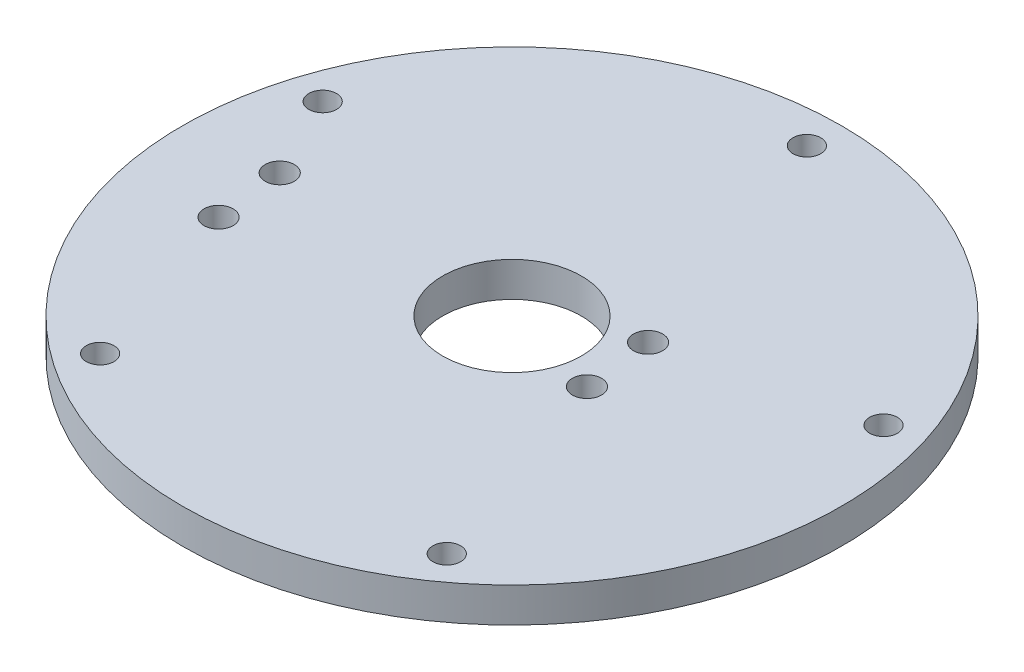
ISO-10303-21;
HEADER;
FILE_DESCRIPTION(('STEP AP214'),'2;1');
FILE_NAME('part.step','',(''),(''),'','','');
FILE_SCHEMA(('AUTOMOTIVE_DESIGN { 1 0 10303 214 1 1 1 1 }'));
ENDSEC;
DATA;
#1=APPLICATION_CONTEXT('core data for automotive mechanical design processes');
#2=APPLICATION_PROTOCOL_DEFINITION('international standard','automotive_design',2000,#1);
#3=PRODUCT_CONTEXT('',#1,'mechanical');
#4=PRODUCT('Part','Part','',(#3));
#5=PRODUCT_RELATED_PRODUCT_CATEGORY('part','',(#4));
#6=PRODUCT_DEFINITION_FORMATION('','',#4);
#7=PRODUCT_DEFINITION_CONTEXT('part definition',#1,'design');
#8=PRODUCT_DEFINITION('design','',#6,#7);
#9=PRODUCT_DEFINITION_SHAPE('','',#8);
#10=(LENGTH_UNIT() NAMED_UNIT(*) SI_UNIT(.MILLI.,.METRE.));
#11=(NAMED_UNIT(*) PLANE_ANGLE_UNIT() SI_UNIT($,.RADIAN.));
#12=(NAMED_UNIT(*) SI_UNIT($,.STERADIAN.) SOLID_ANGLE_UNIT());
#13=UNCERTAINTY_MEASURE_WITH_UNIT(LENGTH_MEASURE(1.E-05),#10,'distance_accuracy_value','');
#14=(GEOMETRIC_REPRESENTATION_CONTEXT(3) GLOBAL_UNCERTAINTY_ASSIGNED_CONTEXT((#13)) GLOBAL_UNIT_ASSIGNED_CONTEXT((#10,
#11,#12)) REPRESENTATION_CONTEXT('',''));
#15=CARTESIAN_POINT('',(0.,0.,0.));
#16=DIRECTION('',(0.,0.,1.));
#17=DIRECTION('',(1.,0.,0.));
#18=AXIS2_PLACEMENT_3D('',#15,#16,#17);
#19=CARTESIAN_POINT('',(0.,5.,0.));
#20=DIRECTION('',(0.,1.,0.));
#21=DIRECTION('',(0.,0.,1.));
#22=AXIS2_PLACEMENT_3D('',#19,#20,#21);
#23=PLANE('',#22);
#24=CARTESIAN_POINT('',(-33.4703200578218,5.,8.8204407614914));
#25=DIRECTION('',(0.,1.,0.));
#26=DIRECTION('',(0.,0.,1.));
#27=AXIS2_PLACEMENT_3D('',#24,#25,#26);
#28=CIRCLE('',#27,2.1);
#29=CARTESIAN_POINT('',(-33.4703200578218,5.,10.9204407614914));
#30=VERTEX_POINT('',#29);
#31=EDGE_CURVE('E88',#30,#30,#28,.T.);
#32=ORIENTED_EDGE('',*,*,#31,.F.);
#33=EDGE_LOOP('',(#32));
#34=FACE_BOUND('',#33,.T.);
#35=CARTESIAN_POINT('',(-40.4199019425432,5.,-13.1332222609341));
#36=DIRECTION('',(0.,1.,0.));
#37=DIRECTION('',(0.,0.,1.));
#38=AXIS2_PLACEMENT_3D('',#35,#36,#37);
#39=CIRCLE('',#38,2.00000000000161);
#40=CARTESIAN_POINT('',(-40.4199019425432,5.,-11.1332222609325));
#41=VERTEX_POINT('',#40);
#42=EDGE_CURVE('E76',#41,#41,#39,.T.);
#43=ORIENTED_EDGE('',*,*,#42,.F.);
#44=EDGE_LOOP('',(#43));
#45=FACE_BOUND('',#44,.T.);
#46=CARTESIAN_POINT('',(24.9808732224323,5.,34.3832222609346));
#47=DIRECTION('',(0.,1.,0.));
#48=DIRECTION('',(0.,0.,1.));
#49=AXIS2_PLACEMENT_3D('',#46,#47,#48);
#50=CIRCLE('',#49,2.00000000000211);
#51=CARTESIAN_POINT('',(24.9808732224323,5.,36.3832222609367));
#52=VERTEX_POINT('',#51);
#53=EDGE_CURVE('E64',#52,#52,#50,.T.);
#54=ORIENTED_EDGE('',*,*,#53,.F.);
#55=EDGE_LOOP('',(#54));
#56=FACE_BOUND('',#55,.T.);
#57=CARTESIAN_POINT('',(-34.595040143727,5.,-1.11610817304123));
#58=DIRECTION('',(0.,1.,0.));
#59=DIRECTION('',(0.,0.,1.));
#60=AXIS2_PLACEMENT_3D('',#57,#58,#59);
#61=CIRCLE('',#60,2.1);
#62=CARTESIAN_POINT('',(-34.595040143727,5.,0.983891826958772));
#63=VERTEX_POINT('',#62);
#64=EDGE_CURVE('E52',#63,#63,#61,.T.);
#65=ORIENTED_EDGE('',*,*,#64,.F.);
#66=EDGE_LOOP('',(#65));
#67=FACE_BOUND('',#66,.T.);
#68=CARTESIAN_POINT('',(0.,5.,-42.5));
#69=DIRECTION('',(0.,1.,0.));
#70=DIRECTION('',(0.,0.,1.));
#71=AXIS2_PLACEMENT_3D('',#68,#69,#70);
#72=CIRCLE('',#71,2.);
#73=CARTESIAN_POINT('',(0.,5.,-40.5));
#74=VERTEX_POINT('',#73);
#75=EDGE_CURVE('E41',#74,#74,#72,.T.);
#76=ORIENTED_EDGE('',*,*,#75,.F.);
#77=EDGE_LOOP('',(#76));
#78=FACE_BOUND('',#77,.T.);
#79=CARTESIAN_POINT('',(0.,5.,0.));
#80=DIRECTION('',(0.,1.,0.));
#81=DIRECTION('',(0.,0.,1.));
#82=AXIS2_PLACEMENT_3D('',#79,#80,#81);
#83=CIRCLE('',#82,47.5);
#84=CARTESIAN_POINT('',(0.,5.,47.5));
#85=VERTEX_POINT('',#84);
#86=EDGE_CURVE('E10',#85,#85,#83,.T.);
#87=ORIENTED_EDGE('',*,*,#86,.T.);
#88=EDGE_LOOP('',(#87));
#89=FACE_BOUND('',#88,.T.);
#90=CARTESIAN_POINT('',(0.,5.,0.));
#91=DIRECTION('',(0.,1.,0.));
#92=DIRECTION('',(0.,0.,1.));
#93=AXIS2_PLACEMENT_3D('',#90,#91,#92);
#94=CIRCLE('',#93,10.);
#95=CARTESIAN_POINT('',(0.,5.,10.));
#96=VERTEX_POINT('',#95);
#97=EDGE_CURVE('E46',#96,#96,#94,.T.);
#98=ORIENTED_EDGE('',*,*,#97,.F.);
#99=EDGE_LOOP('',(#98));
#100=FACE_BOUND('',#99,.T.);
#101=CARTESIAN_POINT('',(40.4199019425449,5.,-13.1332222609364));
#102=DIRECTION('',(0.,1.,0.));
#103=DIRECTION('',(0.,0.,1.));
#104=AXIS2_PLACEMENT_3D('',#101,#102,#103);
#105=CIRCLE('',#104,2.00000000000058);
#106=CARTESIAN_POINT('',(40.4199019425449,5.,-11.1332222609358));
#107=VERTEX_POINT('',#106);
#108=EDGE_CURVE('E58',#107,#107,#105,.T.);
#109=ORIENTED_EDGE('',*,*,#108,.F.);
#110=EDGE_LOOP('',(#109));
#111=FACE_BOUND('',#110,.T.);
#112=CARTESIAN_POINT('',(-24.9808732224279,5.,34.383222260936));
#113=DIRECTION('',(0.,1.,0.));
#114=DIRECTION('',(0.,0.,1.));
#115=AXIS2_PLACEMENT_3D('',#112,#113,#114);
#116=CIRCLE('',#115,2.00000000000265);
#117=CARTESIAN_POINT('',(-24.9808732224279,5.,36.3832222609386));
#118=VERTEX_POINT('',#117);
#119=EDGE_CURVE('E70',#118,#118,#116,.T.);
#120=ORIENTED_EDGE('',*,*,#119,.F.);
#121=EDGE_LOOP('',(#120));
#122=FACE_BOUND('',#121,.T.);
#123=CARTESIAN_POINT('',(14.2251148279348,5.,3.42178434914677));
#124=DIRECTION('',(0.,1.,0.));
#125=DIRECTION('',(0.,0.,1.));
#126=AXIS2_PLACEMENT_3D('',#123,#124,#125);
#127=CIRCLE('',#126,2.1);
#128=CARTESIAN_POINT('',(14.2251148279348,5.,5.52178434914677));
#129=VERTEX_POINT('',#128);
#130=EDGE_CURVE('E82',#129,#129,#127,.T.);
#131=ORIENTED_EDGE('',*,*,#130,.F.);
#132=EDGE_LOOP('',(#131));
#133=FACE_BOUND('',#132,.T.);
#134=CARTESIAN_POINT('',(13.1003947420297,5.,-6.51476458538586));
#135=DIRECTION('',(0.,1.,0.));
#136=DIRECTION('',(0.,0.,1.));
#137=AXIS2_PLACEMENT_3D('',#134,#135,#136);
#138=CIRCLE('',#137,2.1);
#139=CARTESIAN_POINT('',(13.1003947420297,5.,-4.41476458538586));
#140=VERTEX_POINT('',#139);
#141=EDGE_CURVE('E94',#140,#140,#138,.T.);
#142=ORIENTED_EDGE('',*,*,#141,.F.);
#143=EDGE_LOOP('',(#142));
#144=FACE_BOUND('',#143,.T.);
#145=ADVANCED_FACE('F30',(#34,#45,#56,#67,#78,#89,#100,#111,#122,#133,#144),#23,.T.);
#146=CARTESIAN_POINT('',(0.,0.,0.));
#147=DIRECTION('',(0.,1.,0.));
#148=DIRECTION('',(0.,0.,1.));
#149=AXIS2_PLACEMENT_3D('',#146,#147,#148);
#150=PLANE('',#149);
#151=CARTESIAN_POINT('',(0.,0.,0.));
#152=DIRECTION('',(0.,1.,0.));
#153=DIRECTION('',(0.,0.,1.));
#154=AXIS2_PLACEMENT_3D('',#151,#152,#153);
#155=CIRCLE('',#154,47.5);
#156=CARTESIAN_POINT('',(0.,0.,47.5));
#157=VERTEX_POINT('',#156);
#158=EDGE_CURVE('E34',#157,#157,#155,.T.);
#159=ORIENTED_EDGE('',*,*,#158,.F.);
#160=EDGE_LOOP('',(#159));
#161=FACE_BOUND('',#160,.T.);
#162=CARTESIAN_POINT('',(0.,0.,-42.5));
#163=DIRECTION('',(0.,1.,0.));
#164=DIRECTION('',(0.,0.,1.));
#165=AXIS2_PLACEMENT_3D('',#162,#163,#164);
#166=CIRCLE('',#165,2.);
#167=CARTESIAN_POINT('',(0.,0.,-40.5));
#168=VERTEX_POINT('',#167);
#169=EDGE_CURVE('E43',#168,#168,#166,.T.);
#170=ORIENTED_EDGE('',*,*,#169,.T.);
#171=EDGE_LOOP('',(#170));
#172=FACE_BOUND('',#171,.T.);
#173=CARTESIAN_POINT('',(0.,0.,0.));
#174=DIRECTION('',(0.,1.,0.));
#175=DIRECTION('',(0.,0.,1.));
#176=AXIS2_PLACEMENT_3D('',#173,#174,#175);
#177=CIRCLE('',#176,10.);
#178=CARTESIAN_POINT('',(0.,0.,10.));
#179=VERTEX_POINT('',#178);
#180=EDGE_CURVE('E49',#179,#179,#177,.T.);
#181=ORIENTED_EDGE('',*,*,#180,.T.);
#182=EDGE_LOOP('',(#181));
#183=FACE_BOUND('',#182,.T.);
#184=CARTESIAN_POINT('',(-34.595040143727,0.,-1.11610817304123));
#185=DIRECTION('',(0.,1.,0.));
#186=DIRECTION('',(0.,0.,1.));
#187=AXIS2_PLACEMENT_3D('',#184,#185,#186);
#188=CIRCLE('',#187,2.1);
#189=CARTESIAN_POINT('',(-34.595040143727,0.,0.983891826958772));
#190=VERTEX_POINT('',#189);
#191=EDGE_CURVE('E55',#190,#190,#188,.T.);
#192=ORIENTED_EDGE('',*,*,#191,.T.);
#193=EDGE_LOOP('',(#192));
#194=FACE_BOUND('',#193,.T.);
#195=CARTESIAN_POINT('',(40.4199019425449,0.,-13.1332222609364));
#196=DIRECTION('',(0.,1.,0.));
#197=DIRECTION('',(0.,0.,1.));
#198=AXIS2_PLACEMENT_3D('',#195,#196,#197);
#199=CIRCLE('',#198,2.00000000000058);
#200=CARTESIAN_POINT('',(40.4199019425449,0.,-11.1332222609358));
#201=VERTEX_POINT('',#200);
#202=EDGE_CURVE('E61',#201,#201,#199,.T.);
#203=ORIENTED_EDGE('',*,*,#202,.T.);
#204=EDGE_LOOP('',(#203));
#205=FACE_BOUND('',#204,.T.);
#206=CARTESIAN_POINT('',(24.9808732224323,0.,34.3832222609346));
#207=DIRECTION('',(0.,1.,0.));
#208=DIRECTION('',(0.,0.,1.));
#209=AXIS2_PLACEMENT_3D('',#206,#207,#208);
#210=CIRCLE('',#209,2.00000000000211);
#211=CARTESIAN_POINT('',(24.9808732224323,0.,36.3832222609367));
#212=VERTEX_POINT('',#211);
#213=EDGE_CURVE('E67',#212,#212,#210,.T.);
#214=ORIENTED_EDGE('',*,*,#213,.T.);
#215=EDGE_LOOP('',(#214));
#216=FACE_BOUND('',#215,.T.);
#217=CARTESIAN_POINT('',(-24.9808732224279,0.,34.383222260936));
#218=DIRECTION('',(0.,1.,0.));
#219=DIRECTION('',(0.,0.,1.));
#220=AXIS2_PLACEMENT_3D('',#217,#218,#219);
#221=CIRCLE('',#220,2.00000000000265);
#222=CARTESIAN_POINT('',(-24.9808732224279,0.,36.3832222609386));
#223=VERTEX_POINT('',#222);
#224=EDGE_CURVE('E73',#223,#223,#221,.T.);
#225=ORIENTED_EDGE('',*,*,#224,.T.);
#226=EDGE_LOOP('',(#225));
#227=FACE_BOUND('',#226,.T.);
#228=CARTESIAN_POINT('',(-40.4199019425432,0.,-13.1332222609341));
#229=DIRECTION('',(0.,1.,0.));
#230=DIRECTION('',(0.,0.,1.));
#231=AXIS2_PLACEMENT_3D('',#228,#229,#230);
#232=CIRCLE('',#231,2.00000000000161);
#233=CARTESIAN_POINT('',(-40.4199019425432,0.,-11.1332222609325));
#234=VERTEX_POINT('',#233);
#235=EDGE_CURVE('E79',#234,#234,#232,.T.);
#236=ORIENTED_EDGE('',*,*,#235,.T.);
#237=EDGE_LOOP('',(#236));
#238=FACE_BOUND('',#237,.T.);
#239=CARTESIAN_POINT('',(14.2251148279348,0.,3.42178434914677));
#240=DIRECTION('',(0.,1.,0.));
#241=DIRECTION('',(0.,0.,1.));
#242=AXIS2_PLACEMENT_3D('',#239,#240,#241);
#243=CIRCLE('',#242,2.1);
#244=CARTESIAN_POINT('',(14.2251148279348,0.,5.52178434914677));
#245=VERTEX_POINT('',#244);
#246=EDGE_CURVE('E85',#245,#245,#243,.T.);
#247=ORIENTED_EDGE('',*,*,#246,.T.);
#248=EDGE_LOOP('',(#247));
#249=FACE_BOUND('',#248,.T.);
#250=CARTESIAN_POINT('',(-33.4703200578218,0.,8.8204407614914));
#251=DIRECTION('',(0.,1.,0.));
#252=DIRECTION('',(0.,0.,1.));
#253=AXIS2_PLACEMENT_3D('',#250,#251,#252);
#254=CIRCLE('',#253,2.1);
#255=CARTESIAN_POINT('',(-33.4703200578218,0.,10.9204407614914));
#256=VERTEX_POINT('',#255);
#257=EDGE_CURVE('E91',#256,#256,#254,.T.);
#258=ORIENTED_EDGE('',*,*,#257,.T.);
#259=EDGE_LOOP('',(#258));
#260=FACE_BOUND('',#259,.T.);
#261=CARTESIAN_POINT('',(13.1003947420297,0.,-6.51476458538586));
#262=DIRECTION('',(0.,1.,0.));
#263=DIRECTION('',(0.,0.,1.));
#264=AXIS2_PLACEMENT_3D('',#261,#262,#263);
#265=CIRCLE('',#264,2.1);
#266=CARTESIAN_POINT('',(13.1003947420297,0.,-4.41476458538586));
#267=VERTEX_POINT('',#266);
#268=EDGE_CURVE('E97',#267,#267,#265,.T.);
#269=ORIENTED_EDGE('',*,*,#268,.T.);
#270=EDGE_LOOP('',(#269));
#271=FACE_BOUND('',#270,.T.);
#272=ADVANCED_FACE('F107',(#161,#172,#183,#194,#205,#216,#227,#238,#249,#260,#271),#150,.F.);
#273=CARTESIAN_POINT('',(0.,5.,0.));
#274=DIRECTION('',(0.,-1.,0.));
#275=DIRECTION('',(0.,0.,-1.));
#276=AXIS2_PLACEMENT_3D('',#273,#274,#275);
#277=CYLINDRICAL_SURFACE('',#276,47.5);
#278=ORIENTED_EDGE('',*,*,#86,.F.);
#279=EDGE_LOOP('',(#278));
#280=FACE_BOUND('',#279,.T.);
#281=ORIENTED_EDGE('',*,*,#158,.T.);
#282=EDGE_LOOP('',(#281));
#283=FACE_BOUND('',#282,.T.);
#284=ADVANCED_FACE('F32',(#280,#283),#277,.T.);
#285=CARTESIAN_POINT('',(0.,5.,-42.5));
#286=DIRECTION('',(0.,-1.,0.));
#287=DIRECTION('',(0.,0.,-1.));
#288=AXIS2_PLACEMENT_3D('',#285,#286,#287);
#289=CYLINDRICAL_SURFACE('',#288,2.);
#290=ORIENTED_EDGE('',*,*,#75,.T.);
#291=EDGE_LOOP('',(#290));
#292=FACE_BOUND('',#291,.T.);
#293=ORIENTED_EDGE('',*,*,#169,.F.);
#294=EDGE_LOOP('',(#293));
#295=FACE_BOUND('',#294,.T.);
#296=ADVANCED_FACE('F117',(#292,#295),#289,.F.);
#297=CARTESIAN_POINT('',(0.,5.,0.));
#298=DIRECTION('',(0.,-1.,0.));
#299=DIRECTION('',(0.,0.,-1.));
#300=AXIS2_PLACEMENT_3D('',#297,#298,#299);
#301=CYLINDRICAL_SURFACE('',#300,10.);
#302=ORIENTED_EDGE('',*,*,#97,.T.);
#303=EDGE_LOOP('',(#302));
#304=FACE_BOUND('',#303,.T.);
#305=ORIENTED_EDGE('',*,*,#180,.F.);
#306=EDGE_LOOP('',(#305));
#307=FACE_BOUND('',#306,.T.);
#308=ADVANCED_FACE('F120',(#304,#307),#301,.F.);
#309=CARTESIAN_POINT('',(-34.595040143727,5.,-1.11610817304123));
#310=DIRECTION('',(0.,-1.,0.));
#311=DIRECTION('',(0.,0.,-1.));
#312=AXIS2_PLACEMENT_3D('',#309,#310,#311);
#313=CYLINDRICAL_SURFACE('',#312,2.1);
#314=ORIENTED_EDGE('',*,*,#64,.T.);
#315=EDGE_LOOP('',(#314));
#316=FACE_BOUND('',#315,.T.);
#317=ORIENTED_EDGE('',*,*,#191,.F.);
#318=EDGE_LOOP('',(#317));
#319=FACE_BOUND('',#318,.T.);
#320=ADVANCED_FACE('F124',(#316,#319),#313,.F.);
#321=CARTESIAN_POINT('',(40.4199019425449,5.,-13.1332222609364));
#322=DIRECTION('',(0.,-1.,0.));
#323=DIRECTION('',(0.,0.,-1.));
#324=AXIS2_PLACEMENT_3D('',#321,#322,#323);
#325=CYLINDRICAL_SURFACE('',#324,2.00000000000058);
#326=ORIENTED_EDGE('',*,*,#108,.T.);
#327=EDGE_LOOP('',(#326));
#328=FACE_BOUND('',#327,.T.);
#329=ORIENTED_EDGE('',*,*,#202,.F.);
#330=EDGE_LOOP('',(#329));
#331=FACE_BOUND('',#330,.T.);
#332=ADVANCED_FACE('F128',(#328,#331),#325,.F.);
#333=CARTESIAN_POINT('',(24.9808732224323,5.,34.3832222609346));
#334=DIRECTION('',(0.,-1.,0.));
#335=DIRECTION('',(0.,0.,-1.));
#336=AXIS2_PLACEMENT_3D('',#333,#334,#335);
#337=CYLINDRICAL_SURFACE('',#336,2.00000000000211);
#338=ORIENTED_EDGE('',*,*,#53,.T.);
#339=EDGE_LOOP('',(#338));
#340=FACE_BOUND('',#339,.T.);
#341=ORIENTED_EDGE('',*,*,#213,.F.);
#342=EDGE_LOOP('',(#341));
#343=FACE_BOUND('',#342,.T.);
#344=ADVANCED_FACE('F132',(#340,#343),#337,.F.);
#345=CARTESIAN_POINT('',(-24.9808732224279,5.,34.383222260936));
#346=DIRECTION('',(0.,-1.,0.));
#347=DIRECTION('',(0.,0.,-1.));
#348=AXIS2_PLACEMENT_3D('',#345,#346,#347);
#349=CYLINDRICAL_SURFACE('',#348,2.00000000000265);
#350=ORIENTED_EDGE('',*,*,#119,.T.);
#351=EDGE_LOOP('',(#350));
#352=FACE_BOUND('',#351,.T.);
#353=ORIENTED_EDGE('',*,*,#224,.F.);
#354=EDGE_LOOP('',(#353));
#355=FACE_BOUND('',#354,.T.);
#356=ADVANCED_FACE('F136',(#352,#355),#349,.F.);
#357=CARTESIAN_POINT('',(-40.4199019425432,5.,-13.1332222609341));
#358=DIRECTION('',(0.,-1.,0.));
#359=DIRECTION('',(0.,0.,-1.));
#360=AXIS2_PLACEMENT_3D('',#357,#358,#359);
#361=CYLINDRICAL_SURFACE('',#360,2.00000000000161);
#362=ORIENTED_EDGE('',*,*,#42,.T.);
#363=EDGE_LOOP('',(#362));
#364=FACE_BOUND('',#363,.T.);
#365=ORIENTED_EDGE('',*,*,#235,.F.);
#366=EDGE_LOOP('',(#365));
#367=FACE_BOUND('',#366,.T.);
#368=ADVANCED_FACE('F140',(#364,#367),#361,.F.);
#369=CARTESIAN_POINT('',(14.2251148279348,5.,3.42178434914677));
#370=DIRECTION('',(0.,-1.,0.));
#371=DIRECTION('',(0.,0.,-1.));
#372=AXIS2_PLACEMENT_3D('',#369,#370,#371);
#373=CYLINDRICAL_SURFACE('',#372,2.1);
#374=ORIENTED_EDGE('',*,*,#130,.T.);
#375=EDGE_LOOP('',(#374));
#376=FACE_BOUND('',#375,.T.);
#377=ORIENTED_EDGE('',*,*,#246,.F.);
#378=EDGE_LOOP('',(#377));
#379=FACE_BOUND('',#378,.T.);
#380=ADVANCED_FACE('F144',(#376,#379),#373,.F.);
#381=CARTESIAN_POINT('',(-33.4703200578218,5.,8.8204407614914));
#382=DIRECTION('',(0.,-1.,0.));
#383=DIRECTION('',(0.,0.,-1.));
#384=AXIS2_PLACEMENT_3D('',#381,#382,#383);
#385=CYLINDRICAL_SURFACE('',#384,2.1);
#386=ORIENTED_EDGE('',*,*,#31,.T.);
#387=EDGE_LOOP('',(#386));
#388=FACE_BOUND('',#387,.T.);
#389=ORIENTED_EDGE('',*,*,#257,.F.);
#390=EDGE_LOOP('',(#389));
#391=FACE_BOUND('',#390,.T.);
#392=ADVANCED_FACE('F148',(#388,#391),#385,.F.);
#393=CARTESIAN_POINT('',(13.1003947420297,5.,-6.51476458538586));
#394=DIRECTION('',(0.,-1.,0.));
#395=DIRECTION('',(0.,0.,-1.));
#396=AXIS2_PLACEMENT_3D('',#393,#394,#395);
#397=CYLINDRICAL_SURFACE('',#396,2.1);
#398=ORIENTED_EDGE('',*,*,#141,.T.);
#399=EDGE_LOOP('',(#398));
#400=FACE_BOUND('',#399,.T.);
#401=ORIENTED_EDGE('',*,*,#268,.F.);
#402=EDGE_LOOP('',(#401));
#403=FACE_BOUND('',#402,.T.);
#404=ADVANCED_FACE('F103',(#400,#403),#397,.F.);
#405=CLOSED_SHELL('',(#145,#272,#284,#296,#308,#320,#332,#344,#356,#368,#380,#392,#404));
#406=MANIFOLD_SOLID_BREP('B2',#405);
#407=ADVANCED_BREP_SHAPE_REPRESENTATION('',(#18,#406),#14);
#408=SHAPE_DEFINITION_REPRESENTATION(#9,#407);
ENDSEC;
END-ISO-10303-21;
